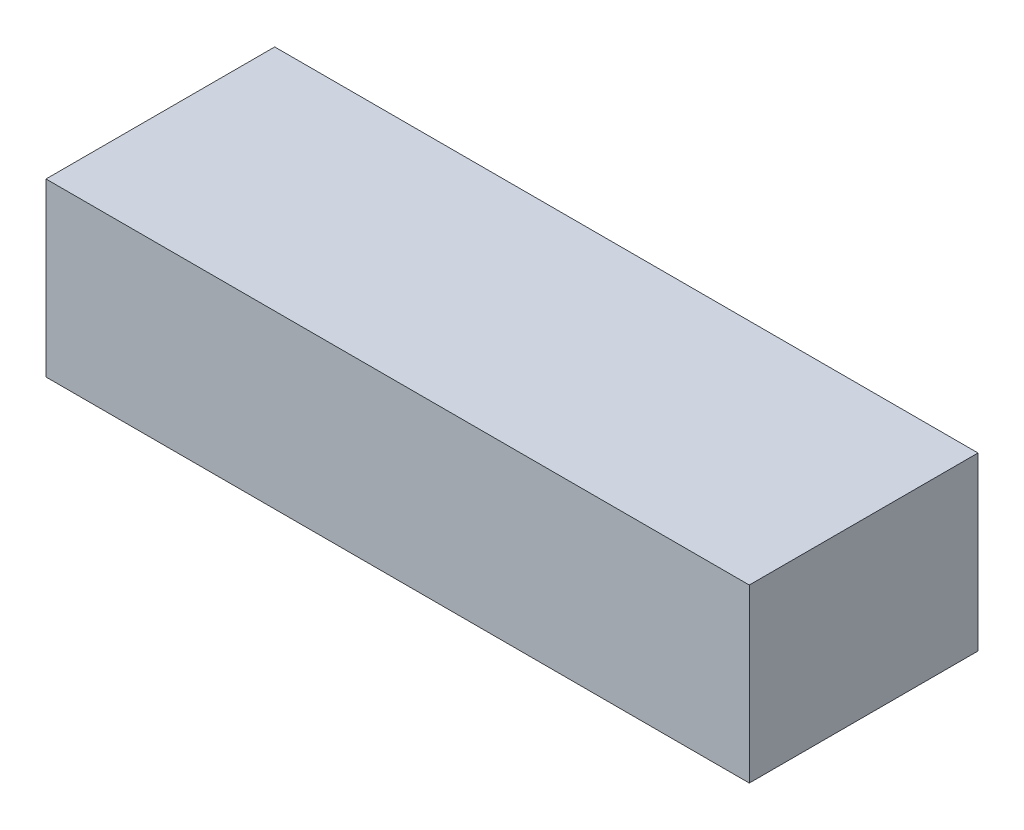
ISO-10303-21;
HEADER;
FILE_DESCRIPTION(('STEP AP214'),'2;1');
FILE_NAME('part.step','',(''),(''),'','','');
FILE_SCHEMA(('AUTOMOTIVE_DESIGN { 1 0 10303 214 1 1 1 1 }'));
ENDSEC;
DATA;
#1=APPLICATION_CONTEXT('core data for automotive mechanical design processes');
#2=APPLICATION_PROTOCOL_DEFINITION('international standard','automotive_design',2000,#1);
#3=PRODUCT_CONTEXT('',#1,'mechanical');
#4=PRODUCT('Part','Part','',(#3));
#5=PRODUCT_RELATED_PRODUCT_CATEGORY('part','',(#4));
#6=PRODUCT_DEFINITION_FORMATION('','',#4);
#7=PRODUCT_DEFINITION_CONTEXT('part definition',#1,'design');
#8=PRODUCT_DEFINITION('design','',#6,#7);
#9=PRODUCT_DEFINITION_SHAPE('','',#8);
#10=(LENGTH_UNIT() NAMED_UNIT(*) SI_UNIT(.MILLI.,.METRE.));
#11=(NAMED_UNIT(*) PLANE_ANGLE_UNIT() SI_UNIT($,.RADIAN.));
#12=(NAMED_UNIT(*) SI_UNIT($,.STERADIAN.) SOLID_ANGLE_UNIT());
#13=UNCERTAINTY_MEASURE_WITH_UNIT(LENGTH_MEASURE(1.E-05),#10,'distance_accuracy_value','');
#14=(GEOMETRIC_REPRESENTATION_CONTEXT(3) GLOBAL_UNCERTAINTY_ASSIGNED_CONTEXT((#13)) GLOBAL_UNIT_ASSIGNED_CONTEXT((#10,
#11,#12)) REPRESENTATION_CONTEXT('',''));
#15=CARTESIAN_POINT('',(0.,0.,0.));
#16=DIRECTION('',(0.,0.,1.));
#17=DIRECTION('',(1.,0.,0.));
#18=AXIS2_PLACEMENT_3D('',#15,#16,#17);
#19=CARTESIAN_POINT('',(0.,0.,40.));
#20=DIRECTION('',(1.,0.,0.));
#21=DIRECTION('',(0.,0.,-1.));
#22=AXIS2_PLACEMENT_3D('',#19,#20,#21);
#23=PLANE('',#22);
#24=DIRECTION('',(0.,-1.,0.));
#25=VECTOR('',#24,1.);
#26=CARTESIAN_POINT('',(0.,0.,0.));
#27=LINE('',#26,#25);
#28=CARTESIAN_POINT('',(0.,30.,0.));
#29=VERTEX_POINT('',#28);
#30=CARTESIAN_POINT('',(0.,0.,0.));
#31=VERTEX_POINT('',#30);
#32=EDGE_CURVE('E107',#29,#31,#27,.T.);
#33=ORIENTED_EDGE('',*,*,#32,.T.);
#34=DIRECTION('',(0.,0.,-1.));
#35=VECTOR('',#34,1.);
#36=CARTESIAN_POINT('',(0.,0.,40.));
#37=LINE('',#36,#35);
#38=CARTESIAN_POINT('',(0.,0.,40.));
#39=VERTEX_POINT('',#38);
#40=EDGE_CURVE('E11',#39,#31,#37,.T.);
#41=ORIENTED_EDGE('',*,*,#40,.F.);
#42=DIRECTION('',(0.,-1.,0.));
#43=VECTOR('',#42,1.);
#44=CARTESIAN_POINT('',(0.,0.,40.));
#45=LINE('',#44,#43);
#46=CARTESIAN_POINT('',(0.,30.,40.));
#47=VERTEX_POINT('',#46);
#48=EDGE_CURVE('E91',#47,#39,#45,.T.);
#49=ORIENTED_EDGE('',*,*,#48,.F.);
#50=DIRECTION('',(0.,0.,-1.));
#51=VECTOR('',#50,1.);
#52=CARTESIAN_POINT('',(0.,30.,40.));
#53=LINE('',#52,#51);
#54=EDGE_CURVE('E103',#47,#29,#53,.T.);
#55=ORIENTED_EDGE('',*,*,#54,.T.);
#56=EDGE_LOOP('',(#33,#41,#49,#55));
#57=FACE_BOUND('',#56,.T.);
#58=ADVANCED_FACE('F39',(#57),#23,.F.);
#59=CARTESIAN_POINT('',(0.,0.,40.));
#60=DIRECTION('',(0.,1.,0.));
#61=DIRECTION('',(0.,0.,1.));
#62=AXIS2_PLACEMENT_3D('',#59,#60,#61);
#63=PLANE('',#62);
#64=DIRECTION('',(1.,0.,0.));
#65=VECTOR('',#64,1.);
#66=CARTESIAN_POINT('',(0.,0.,0.));
#67=LINE('',#66,#65);
#68=CARTESIAN_POINT('',(123.,0.,0.));
#69=VERTEX_POINT('',#68);
#70=EDGE_CURVE('E96',#31,#69,#67,.T.);
#71=ORIENTED_EDGE('',*,*,#70,.T.);
#72=DIRECTION('',(0.,0.,-1.));
#73=VECTOR('',#72,1.);
#74=CARTESIAN_POINT('',(123.,0.,40.));
#75=LINE('',#74,#73);
#76=CARTESIAN_POINT('',(123.,0.,40.));
#77=VERTEX_POINT('',#76);
#78=EDGE_CURVE('E48',#77,#69,#75,.T.);
#79=ORIENTED_EDGE('',*,*,#78,.F.);
#80=DIRECTION('',(1.,0.,0.));
#81=VECTOR('',#80,1.);
#82=CARTESIAN_POINT('',(0.,0.,40.));
#83=LINE('',#82,#81);
#84=EDGE_CURVE('E86',#39,#77,#83,.T.);
#85=ORIENTED_EDGE('',*,*,#84,.F.);
#86=ORIENTED_EDGE('',*,*,#40,.T.);
#87=EDGE_LOOP('',(#71,#79,#85,#86));
#88=FACE_BOUND('',#87,.T.);
#89=ADVANCED_FACE('F95',(#88),#63,.F.);
#90=CARTESIAN_POINT('',(123.,0.,40.));
#91=DIRECTION('',(-1.,0.,0.));
#92=DIRECTION('',(0.,0.,1.));
#93=AXIS2_PLACEMENT_3D('',#90,#91,#92);
#94=PLANE('',#93);
#95=DIRECTION('',(0.,1.,0.));
#96=VECTOR('',#95,1.);
#97=CARTESIAN_POINT('',(123.,0.,0.));
#98=LINE('',#97,#96);
#99=CARTESIAN_POINT('',(123.,30.,0.));
#100=VERTEX_POINT('',#99);
#101=EDGE_CURVE('E73',#69,#100,#98,.T.);
#102=ORIENTED_EDGE('',*,*,#101,.T.);
#103=DIRECTION('',(0.,0.,-1.));
#104=VECTOR('',#103,1.);
#105=CARTESIAN_POINT('',(123.,30.,40.));
#106=LINE('',#105,#104);
#107=CARTESIAN_POINT('',(123.,30.,40.));
#108=VERTEX_POINT('',#107);
#109=EDGE_CURVE('E98',#108,#100,#106,.T.);
#110=ORIENTED_EDGE('',*,*,#109,.F.);
#111=DIRECTION('',(0.,1.,0.));
#112=VECTOR('',#111,1.);
#113=CARTESIAN_POINT('',(123.,0.,40.));
#114=LINE('',#113,#112);
#115=EDGE_CURVE('E89',#77,#108,#114,.T.);
#116=ORIENTED_EDGE('',*,*,#115,.F.);
#117=ORIENTED_EDGE('',*,*,#78,.T.);
#118=EDGE_LOOP('',(#102,#110,#116,#117));
#119=FACE_BOUND('',#118,.T.);
#120=ADVANCED_FACE('F99',(#119),#94,.F.);
#121=CARTESIAN_POINT('',(0.,30.,40.));
#122=DIRECTION('',(0.,-1.,0.));
#123=DIRECTION('',(1.,0.,0.));
#124=AXIS2_PLACEMENT_3D('',#121,#122,#123);
#125=PLANE('',#124);
#126=DIRECTION('',(-1.,0.,0.));
#127=VECTOR('',#126,1.);
#128=CARTESIAN_POINT('',(0.,30.,0.));
#129=LINE('',#128,#127);
#130=EDGE_CURVE('E79',#100,#29,#129,.T.);
#131=ORIENTED_EDGE('',*,*,#130,.T.);
#132=ORIENTED_EDGE('',*,*,#54,.F.);
#133=DIRECTION('',(-1.,0.,0.));
#134=VECTOR('',#133,1.);
#135=CARTESIAN_POINT('',(0.,30.,40.));
#136=LINE('',#135,#134);
#137=EDGE_CURVE('E56',#108,#47,#136,.T.);
#138=ORIENTED_EDGE('',*,*,#137,.F.);
#139=ORIENTED_EDGE('',*,*,#109,.T.);
#140=EDGE_LOOP('',(#131,#132,#138,#139));
#141=FACE_BOUND('',#140,.T.);
#142=ADVANCED_FACE('F120',(#141),#125,.F.);
#143=CARTESIAN_POINT('',(0.,0.,40.));
#144=DIRECTION('',(0.,0.,-1.));
#145=DIRECTION('',(-1.,0.,0.));
#146=AXIS2_PLACEMENT_3D('',#143,#144,#145);
#147=PLANE('',#146);
#148=ORIENTED_EDGE('',*,*,#48,.T.);
#149=ORIENTED_EDGE('',*,*,#84,.T.);
#150=ORIENTED_EDGE('',*,*,#115,.T.);
#151=ORIENTED_EDGE('',*,*,#137,.T.);
#152=EDGE_LOOP('',(#148,#149,#150,#151));
#153=FACE_BOUND('',#152,.T.);
#154=ADVANCED_FACE('F87',(#153),#147,.F.);
#155=CARTESIAN_POINT('',(0.,0.,0.));
#156=DIRECTION('',(0.,0.,-1.));
#157=DIRECTION('',(-1.,0.,0.));
#158=AXIS2_PLACEMENT_3D('',#155,#156,#157);
#159=PLANE('',#158);
#160=ORIENTED_EDGE('',*,*,#32,.F.);
#161=ORIENTED_EDGE('',*,*,#130,.F.);
#162=ORIENTED_EDGE('',*,*,#101,.F.);
#163=ORIENTED_EDGE('',*,*,#70,.F.);
#164=EDGE_LOOP('',(#160,#161,#162,#163));
#165=FACE_BOUND('',#164,.T.);
#166=ADVANCED_FACE('F123',(#165),#159,.T.);
#167=CLOSED_SHELL('',(#58,#89,#120,#142,#154,#166));
#168=MANIFOLD_SOLID_BREP('B2',#167);
#169=ADVANCED_BREP_SHAPE_REPRESENTATION('',(#18,#168),#14);
#170=SHAPE_DEFINITION_REPRESENTATION(#9,#169);
ENDSEC;
END-ISO-10303-21;
